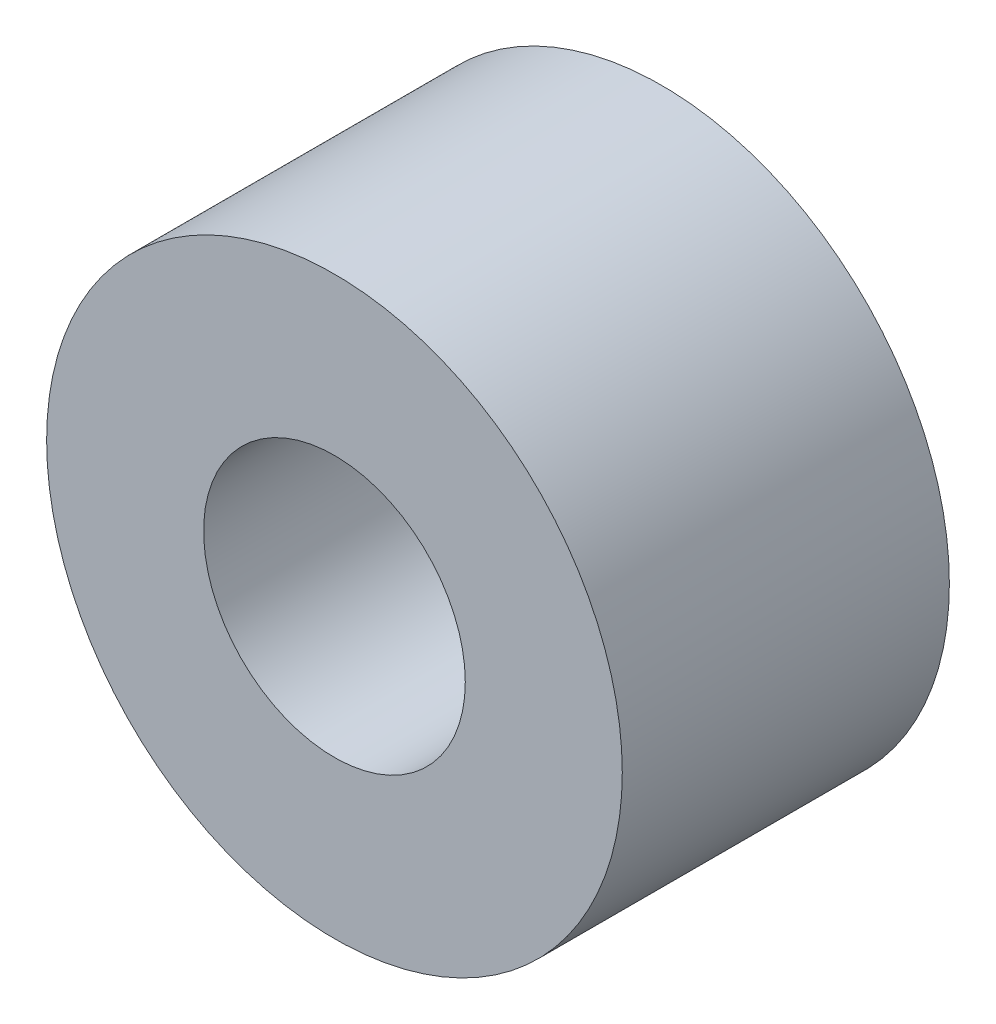
ISO-10303-21;
HEADER;
FILE_DESCRIPTION(('STEP AP214'),'2;1');
FILE_NAME('part.step','',(''),(''),'','','');
FILE_SCHEMA(('AUTOMOTIVE_DESIGN { 1 0 10303 214 1 1 1 1 }'));
ENDSEC;
DATA;
#1=APPLICATION_CONTEXT('core data for automotive mechanical design processes');
#2=APPLICATION_PROTOCOL_DEFINITION('international standard','automotive_design',2000,#1);
#3=PRODUCT_CONTEXT('',#1,'mechanical');
#4=PRODUCT('Part','Part','',(#3));
#5=PRODUCT_RELATED_PRODUCT_CATEGORY('part','',(#4));
#6=PRODUCT_DEFINITION_FORMATION('','',#4);
#7=PRODUCT_DEFINITION_CONTEXT('part definition',#1,'design');
#8=PRODUCT_DEFINITION('design','',#6,#7);
#9=PRODUCT_DEFINITION_SHAPE('','',#8);
#10=(LENGTH_UNIT() NAMED_UNIT(*) SI_UNIT(.MILLI.,.METRE.));
#11=(NAMED_UNIT(*) PLANE_ANGLE_UNIT() SI_UNIT($,.RADIAN.));
#12=(NAMED_UNIT(*) SI_UNIT($,.STERADIAN.) SOLID_ANGLE_UNIT());
#13=UNCERTAINTY_MEASURE_WITH_UNIT(LENGTH_MEASURE(1.E-05),#10,'distance_accuracy_value','');
#14=(GEOMETRIC_REPRESENTATION_CONTEXT(3) GLOBAL_UNCERTAINTY_ASSIGNED_CONTEXT((#13)) GLOBAL_UNIT_ASSIGNED_CONTEXT((#10,
#11,#12)) REPRESENTATION_CONTEXT('',''));
#15=CARTESIAN_POINT('',(0.,0.,0.));
#16=DIRECTION('',(0.,0.,1.));
#17=DIRECTION('',(1.,0.,0.));
#18=AXIS2_PLACEMENT_3D('',#15,#16,#17);
#19=CARTESIAN_POINT('',(0.,0.,4.));
#20=DIRECTION('',(0.,0.,1.));
#21=DIRECTION('',(1.,0.,0.));
#22=AXIS2_PLACEMENT_3D('',#19,#20,#21);
#23=PLANE('',#22);
#24=CARTESIAN_POINT('',(0.,0.,4.));
#25=DIRECTION('',(0.,0.,1.));
#26=DIRECTION('',(1.,0.,0.));
#27=AXIS2_PLACEMENT_3D('',#24,#25,#26);
#28=CIRCLE('',#27,3.52);
#29=CARTESIAN_POINT('',(3.52,0.,4.));
#30=VERTEX_POINT('',#29);
#31=EDGE_CURVE('E10',#30,#30,#28,.T.);
#32=ORIENTED_EDGE('',*,*,#31,.T.);
#33=EDGE_LOOP('',(#32));
#34=FACE_BOUND('',#33,.T.);
#35=CARTESIAN_POINT('',(0.,0.,4.));
#36=DIRECTION('',(0.,0.,1.));
#37=DIRECTION('',(1.,0.,0.));
#38=AXIS2_PLACEMENT_3D('',#35,#36,#37);
#39=CIRCLE('',#38,1.6);
#40=CARTESIAN_POINT('',(1.6,0.,4.));
#41=VERTEX_POINT('',#40);
#42=EDGE_CURVE('E42',#41,#41,#39,.T.);
#43=ORIENTED_EDGE('',*,*,#42,.F.);
#44=EDGE_LOOP('',(#43));
#45=FACE_BOUND('',#44,.T.);
#46=ADVANCED_FACE('F31',(#34,#45),#23,.T.);
#47=CARTESIAN_POINT('',(0.,0.,0.));
#48=DIRECTION('',(0.,0.,1.));
#49=DIRECTION('',(1.,0.,0.));
#50=AXIS2_PLACEMENT_3D('',#47,#48,#49);
#51=PLANE('',#50);
#52=CARTESIAN_POINT('',(0.,0.,0.));
#53=DIRECTION('',(0.,0.,1.));
#54=DIRECTION('',(1.,0.,0.));
#55=AXIS2_PLACEMENT_3D('',#52,#53,#54);
#56=CIRCLE('',#55,3.52);
#57=CARTESIAN_POINT('',(3.52,0.,0.));
#58=VERTEX_POINT('',#57);
#59=EDGE_CURVE('E35',#58,#58,#56,.T.);
#60=ORIENTED_EDGE('',*,*,#59,.F.);
#61=EDGE_LOOP('',(#60));
#62=FACE_BOUND('',#61,.T.);
#63=CARTESIAN_POINT('',(0.,0.,0.));
#64=DIRECTION('',(0.,0.,1.));
#65=DIRECTION('',(1.,0.,0.));
#66=AXIS2_PLACEMENT_3D('',#63,#64,#65);
#67=CIRCLE('',#66,1.6);
#68=CARTESIAN_POINT('',(1.6,0.,0.));
#69=VERTEX_POINT('',#68);
#70=EDGE_CURVE('E44',#69,#69,#67,.T.);
#71=ORIENTED_EDGE('',*,*,#70,.T.);
#72=EDGE_LOOP('',(#71));
#73=FACE_BOUND('',#72,.T.);
#74=ADVANCED_FACE('F54',(#62,#73),#51,.F.);
#75=CARTESIAN_POINT('',(0.,0.,4.));
#76=DIRECTION('',(0.,0.,-1.));
#77=DIRECTION('',(-1.,0.,0.));
#78=AXIS2_PLACEMENT_3D('',#75,#76,#77);
#79=CYLINDRICAL_SURFACE('',#78,3.52);
#80=ORIENTED_EDGE('',*,*,#31,.F.);
#81=EDGE_LOOP('',(#80));
#82=FACE_BOUND('',#81,.T.);
#83=ORIENTED_EDGE('',*,*,#59,.T.);
#84=EDGE_LOOP('',(#83));
#85=FACE_BOUND('',#84,.T.);
#86=ADVANCED_FACE('F33',(#82,#85),#79,.T.);
#87=CARTESIAN_POINT('',(0.,0.,4.));
#88=DIRECTION('',(0.,0.,-1.));
#89=DIRECTION('',(-1.,0.,0.));
#90=AXIS2_PLACEMENT_3D('',#87,#88,#89);
#91=CYLINDRICAL_SURFACE('',#90,1.6);
#92=ORIENTED_EDGE('',*,*,#42,.T.);
#93=EDGE_LOOP('',(#92));
#94=FACE_BOUND('',#93,.T.);
#95=ORIENTED_EDGE('',*,*,#70,.F.);
#96=EDGE_LOOP('',(#95));
#97=FACE_BOUND('',#96,.T.);
#98=ADVANCED_FACE('F50',(#94,#97),#91,.F.);
#99=CLOSED_SHELL('',(#46,#74,#86,#98));
#100=MANIFOLD_SOLID_BREP('B2',#99);
#101=ADVANCED_BREP_SHAPE_REPRESENTATION('',(#18,#100),#14);
#102=SHAPE_DEFINITION_REPRESENTATION(#9,#101);
ENDSEC;
END-ISO-10303-21;
